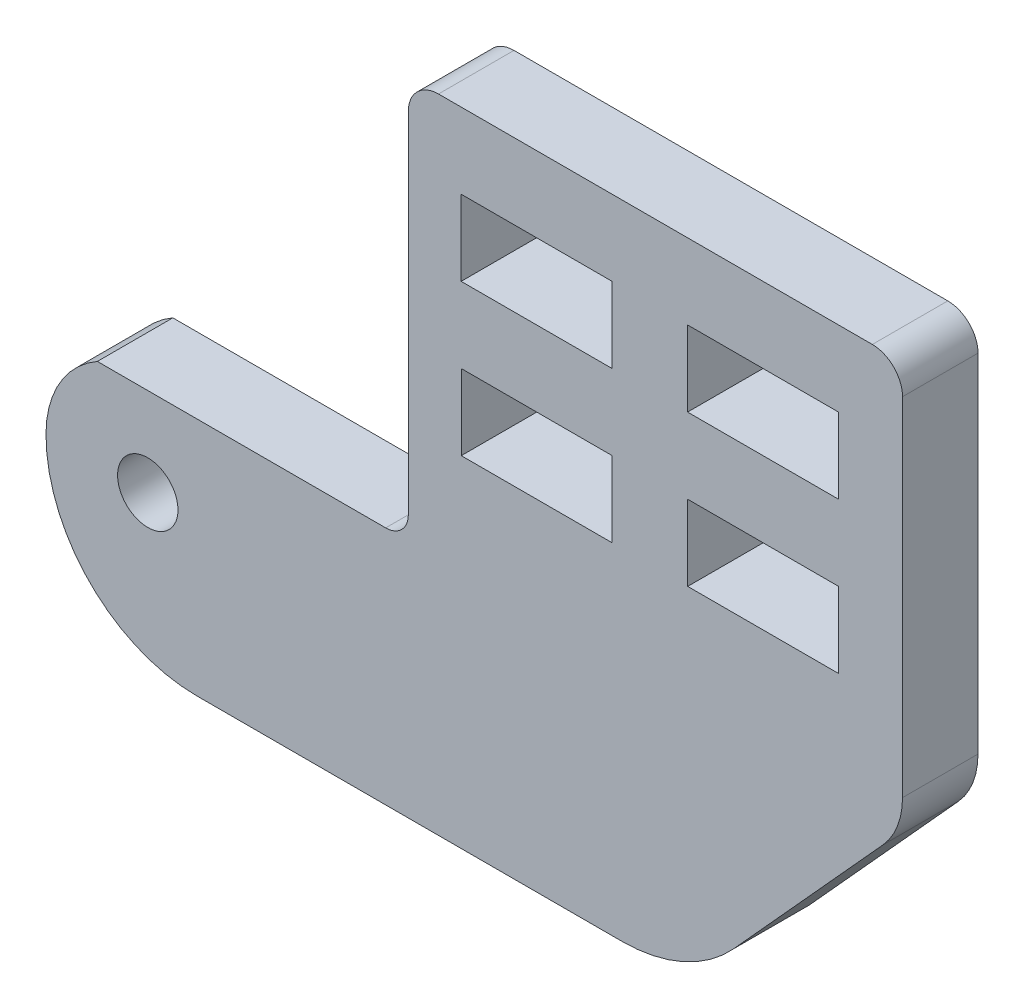
ISO-10303-21;
HEADER;
FILE_DESCRIPTION(('STEP AP214'),'2;1');
FILE_NAME('part.step','',(''),(''),'','','');
FILE_SCHEMA(('AUTOMOTIVE_DESIGN { 1 0 10303 214 1 1 1 1 }'));
ENDSEC;
DATA;
#1=APPLICATION_CONTEXT('core data for automotive mechanical design processes');
#2=APPLICATION_PROTOCOL_DEFINITION('international standard','automotive_design',2000,#1);
#3=PRODUCT_CONTEXT('',#1,'mechanical');
#4=PRODUCT('Part','Part','',(#3));
#5=PRODUCT_RELATED_PRODUCT_CATEGORY('part','',(#4));
#6=PRODUCT_DEFINITION_FORMATION('','',#4);
#7=PRODUCT_DEFINITION_CONTEXT('part definition',#1,'design');
#8=PRODUCT_DEFINITION('design','',#6,#7);
#9=PRODUCT_DEFINITION_SHAPE('','',#8);
#10=(LENGTH_UNIT() NAMED_UNIT(*) SI_UNIT(.MILLI.,.METRE.));
#11=(NAMED_UNIT(*) PLANE_ANGLE_UNIT() SI_UNIT($,.RADIAN.));
#12=(NAMED_UNIT(*) SI_UNIT($,.STERADIAN.) SOLID_ANGLE_UNIT());
#13=UNCERTAINTY_MEASURE_WITH_UNIT(LENGTH_MEASURE(1.E-05),#10,'distance_accuracy_value','');
#14=(GEOMETRIC_REPRESENTATION_CONTEXT(3) GLOBAL_UNCERTAINTY_ASSIGNED_CONTEXT((#13)) GLOBAL_UNIT_ASSIGNED_CONTEXT((#10,
#11,#12)) REPRESENTATION_CONTEXT('',''));
#15=CARTESIAN_POINT('',(0.,0.,0.));
#16=DIRECTION('',(0.,0.,1.));
#17=DIRECTION('',(1.,0.,0.));
#18=AXIS2_PLACEMENT_3D('',#15,#16,#17);
#19=CARTESIAN_POINT('',(-1.74201988749175,-0.0393095547088036,5.));
#20=DIRECTION('',(0.,0.,1.));
#21=DIRECTION('',(1.,0.,0.));
#22=AXIS2_PLACEMENT_3D('',#19,#20,#21);
#23=PLANE('',#22);
#24=CARTESIAN_POINT('',(-1.74201988749175,-0.0393095547088036,5.));
#25=DIRECTION('',(0.,0.,1.));
#26=DIRECTION('',(1.,0.,0.));
#27=AXIS2_PLACEMENT_3D('',#24,#25,#26);
#28=CIRCLE('',#27,10.);
#29=CARTESIAN_POINT('',(-11.7419426251387,0.,5.));
#30=VERTEX_POINT('',#29);
#31=CARTESIAN_POINT('',(-1.74201988749165,-10.0393095547088,5.));
#32=VERTEX_POINT('',#31);
#33=EDGE_CURVE('E358',#30,#32,#28,.T.);
#34=ORIENTED_EDGE('',*,*,#33,.T.);
#35=DIRECTION('',(1.,0.,0.));
#36=VECTOR('',#35,1.);
#37=CARTESIAN_POINT('',(-1.74201988749165,-10.0393095547088,5.));
#38=LINE('',#37,#36);
#39=CARTESIAN_POINT('',(26.4116259065431,-10.0393095547088,5.));
#40=VERTEX_POINT('',#39);
#41=EDGE_CURVE('E361',#32,#40,#38,.T.);
#42=ORIENTED_EDGE('',*,*,#41,.T.);
#43=CARTESIAN_POINT('',(26.4116259065431,-0.0393095547088045,5.));
#44=DIRECTION('',(0.,0.,1.));
#45=DIRECTION('',(-1.,0.,0.));
#46=AXIS2_PLACEMENT_3D('',#43,#44,#45);
#47=CIRCLE('',#46,10.);
#48=CARTESIAN_POINT('',(33.8187494073413,-6.75753264150215,5.));
#49=VERTEX_POINT('',#48);
#50=EDGE_CURVE('E364',#40,#49,#47,.T.);
#51=ORIENTED_EDGE('',*,*,#50,.T.);
#52=DIRECTION('',(0.671822308679337,0.740712350079817,0.));
#53=VECTOR('',#52,1.);
#54=CARTESIAN_POINT('',(43.703561537583,4.14088845660329,5.));
#55=LINE('',#54,#53);
#56=CARTESIAN_POINT('',(43.703561537583,4.14088845660329,5.));
#57=VERTEX_POINT('',#56);
#58=EDGE_CURVE('E366',#49,#57,#55,.T.);
#59=ORIENTED_EDGE('',*,*,#58,.T.);
#60=CARTESIAN_POINT('',(39.9999997871839,7.49999999999998,5.));
#61=DIRECTION('',(0.,0.,1.));
#62=DIRECTION('',(-1.,0.,0.));
#63=AXIS2_PLACEMENT_3D('',#60,#61,#62);
#64=CIRCLE('',#63,5.);
#65=CARTESIAN_POINT('',(44.9999997871839,7.5,5.));
#66=VERTEX_POINT('',#65);
#67=EDGE_CURVE('E368',#57,#66,#64,.T.);
#68=ORIENTED_EDGE('',*,*,#67,.T.);
#69=DIRECTION('',(0.,1.,0.));
#70=VECTOR('',#69,1.);
#71=CARTESIAN_POINT('',(44.9999997871839,7.5,5.));
#72=LINE('',#71,#70);
#73=CARTESIAN_POINT('',(44.9999997871839,30.5,5.));
#74=VERTEX_POINT('',#73);
#75=EDGE_CURVE('E370',#66,#74,#72,.T.);
#76=ORIENTED_EDGE('',*,*,#75,.T.);
#77=CARTESIAN_POINT('',(42.9999997871839,30.5,5.));
#78=DIRECTION('',(0.,0.,1.));
#79=DIRECTION('',(1.,0.,0.));
#80=AXIS2_PLACEMENT_3D('',#77,#78,#79);
#81=CIRCLE('',#80,2.);
#82=CARTESIAN_POINT('',(42.9999997871839,32.5,5.));
#83=VERTEX_POINT('',#82);
#84=EDGE_CURVE('E372',#74,#83,#81,.T.);
#85=ORIENTED_EDGE('',*,*,#84,.T.);
#86=DIRECTION('',(-1.,0.,0.));
#87=VECTOR('',#86,1.);
#88=CARTESIAN_POINT('',(14.2603625156181,32.5,5.));
#89=LINE('',#88,#87);
#90=CARTESIAN_POINT('',(14.2603625156181,32.5,5.));
#91=VERTEX_POINT('',#90);
#92=EDGE_CURVE('E374',#83,#91,#89,.T.);
#93=ORIENTED_EDGE('',*,*,#92,.T.);
#94=CARTESIAN_POINT('',(14.260362515618,30.5,5.));
#95=DIRECTION('',(0.,0.,1.));
#96=DIRECTION('',(-1.,0.,0.));
#97=AXIS2_PLACEMENT_3D('',#94,#95,#96);
#98=CIRCLE('',#97,2.);
#99=CARTESIAN_POINT('',(12.260362515618,30.5,5.));
#100=VERTEX_POINT('',#99);
#101=EDGE_CURVE('E376',#91,#100,#98,.T.);
#102=ORIENTED_EDGE('',*,*,#101,.T.);
#103=DIRECTION('',(0.,-1.,0.));
#104=VECTOR('',#103,1.);
#105=CARTESIAN_POINT('',(12.260362515618,7.35621750937084,5.));
#106=LINE('',#105,#104);
#107=CARTESIAN_POINT('',(12.260362515618,7.35621750937084,5.));
#108=VERTEX_POINT('',#107);
#109=EDGE_CURVE('E378',#100,#108,#106,.T.);
#110=ORIENTED_EDGE('',*,*,#109,.T.);
#111=CARTESIAN_POINT('',(10.760362515618,7.35621750937083,5.));
#112=DIRECTION('',(0.,0.,-1.));
#113=DIRECTION('',(-1.,0.,0.));
#114=AXIS2_PLACEMENT_3D('',#111,#112,#113);
#115=CIRCLE('',#114,1.5);
#116=CARTESIAN_POINT('',(10.760362515618,5.85621750937083,5.));
#117=VERTEX_POINT('',#116);
#118=EDGE_CURVE('E380',#108,#117,#115,.T.);
#119=ORIENTED_EDGE('',*,*,#118,.T.);
#120=DIRECTION('',(-1.,0.,0.));
#121=VECTOR('',#120,1.);
#122=CARTESIAN_POINT('',(10.760362515618,5.85621750937083,5.));
#123=LINE('',#122,#121);
#124=CARTESIAN_POINT('',(-8.34043512788392,5.85621750937083,5.));
#125=VERTEX_POINT('',#124);
#126=EDGE_CURVE('E382',#117,#125,#123,.T.);
#127=ORIENTED_EDGE('',*,*,#126,.T.);
#128=CARTESIAN_POINT('',(-5.,0.,5.));
#129=DIRECTION('',(0.,0.,1.));
#130=DIRECTION('',(-1.,0.,0.));
#131=AXIS2_PLACEMENT_3D('',#128,#129,#130);
#132=CIRCLE('',#131,6.74194262513871);
#133=EDGE_CURVE('E384',#125,#30,#132,.T.);
#134=ORIENTED_EDGE('',*,*,#133,.T.);
#135=EDGE_LOOP('',(#34,#42,#51,#59,#68,#76,#85,#93,#102,#110,#119,#127,#134));
#136=FACE_BOUND('',#135,.T.);
#137=CARTESIAN_POINT('',(-5.,0.,5.));
#138=DIRECTION('',(0.,0.,1.));
#139=DIRECTION('',(1.,0.,0.));
#140=AXIS2_PLACEMENT_3D('',#137,#138,#139);
#141=CIRCLE('',#140,2.);
#142=CARTESIAN_POINT('',(-3.,0.,5.));
#143=VERTEX_POINT('',#142);
#144=EDGE_CURVE('E352',#143,#143,#141,.T.);
#145=ORIENTED_EDGE('',*,*,#144,.F.);
#146=EDGE_LOOP('',(#145));
#147=FACE_BOUND('',#146,.T.);
#148=DIRECTION('',(1.,0.,0.));
#149=VECTOR('',#148,1.);
#150=CARTESIAN_POINT('',(15.760362515618,22.5,5.));
#151=LINE('',#150,#149);
#152=CARTESIAN_POINT('',(15.760362515618,22.5,5.));
#153=VERTEX_POINT('',#152);
#154=CARTESIAN_POINT('',(25.760362515618,22.5,5.));
#155=VERTEX_POINT('',#154);
#156=EDGE_CURVE('E323',#153,#155,#151,.T.);
#157=ORIENTED_EDGE('',*,*,#156,.F.);
#158=DIRECTION('',(0.,-1.,0.));
#159=VECTOR('',#158,1.);
#160=CARTESIAN_POINT('',(15.760362515618,27.5,5.));
#161=LINE('',#160,#159);
#162=CARTESIAN_POINT('',(15.760362515618,27.5,5.));
#163=VERTEX_POINT('',#162);
#164=EDGE_CURVE('E321',#163,#153,#161,.T.);
#165=ORIENTED_EDGE('',*,*,#164,.F.);
#166=DIRECTION('',(-1.,0.,0.));
#167=VECTOR('',#166,1.);
#168=CARTESIAN_POINT('',(15.760362515618,27.5,5.));
#169=LINE('',#168,#167);
#170=CARTESIAN_POINT('',(25.760362515618,27.5,5.));
#171=VERTEX_POINT('',#170);
#172=EDGE_CURVE('E329',#171,#163,#169,.T.);
#173=ORIENTED_EDGE('',*,*,#172,.F.);
#174=DIRECTION('',(0.,1.,0.));
#175=VECTOR('',#174,1.);
#176=CARTESIAN_POINT('',(25.760362515618,27.5,5.));
#177=LINE('',#176,#175);
#178=EDGE_CURVE('E326',#155,#171,#177,.T.);
#179=ORIENTED_EDGE('',*,*,#178,.F.);
#180=EDGE_LOOP('',(#157,#165,#173,#179));
#181=FACE_BOUND('',#180,.T.);
#182=DIRECTION('',(1.,0.,0.));
#183=VECTOR('',#182,1.);
#184=CARTESIAN_POINT('',(30.760362515618,22.5,5.));
#185=LINE('',#184,#183);
#186=CARTESIAN_POINT('',(30.760362515618,22.5,5.));
#187=VERTEX_POINT('',#186);
#188=CARTESIAN_POINT('',(40.760362515618,22.5,5.));
#189=VERTEX_POINT('',#188);
#190=EDGE_CURVE('E292',#187,#189,#185,.T.);
#191=ORIENTED_EDGE('',*,*,#190,.F.);
#192=DIRECTION('',(0.,-1.,0.));
#193=VECTOR('',#192,1.);
#194=CARTESIAN_POINT('',(30.760362515618,27.5,5.));
#195=LINE('',#194,#193);
#196=CARTESIAN_POINT('',(30.760362515618,27.5,5.));
#197=VERTEX_POINT('',#196);
#198=EDGE_CURVE('E290',#197,#187,#195,.T.);
#199=ORIENTED_EDGE('',*,*,#198,.F.);
#200=DIRECTION('',(-1.,0.,0.));
#201=VECTOR('',#200,1.);
#202=CARTESIAN_POINT('',(30.760362515618,27.5,5.));
#203=LINE('',#202,#201);
#204=CARTESIAN_POINT('',(40.760362515618,27.5,5.));
#205=VERTEX_POINT('',#204);
#206=EDGE_CURVE('E298',#205,#197,#203,.T.);
#207=ORIENTED_EDGE('',*,*,#206,.F.);
#208=DIRECTION('',(0.,1.,0.));
#209=VECTOR('',#208,1.);
#210=CARTESIAN_POINT('',(40.760362515618,27.5,5.));
#211=LINE('',#210,#209);
#212=EDGE_CURVE('E295',#189,#205,#211,.T.);
#213=ORIENTED_EDGE('',*,*,#212,.F.);
#214=EDGE_LOOP('',(#191,#199,#207,#213));
#215=FACE_BOUND('',#214,.T.);
#216=DIRECTION('',(1.,0.,0.));
#217=VECTOR('',#216,1.);
#218=CARTESIAN_POINT('',(15.7685598453756,12.5031103441985,5.));
#219=LINE('',#218,#217);
#220=CARTESIAN_POINT('',(15.7685598453756,12.5031103441985,5.));
#221=VERTEX_POINT('',#220);
#222=CARTESIAN_POINT('',(25.7685598453756,12.5031103441985,5.));
#223=VERTEX_POINT('',#222);
#224=EDGE_CURVE('E261',#221,#223,#219,.T.);
#225=ORIENTED_EDGE('',*,*,#224,.F.);
#226=DIRECTION('',(0.,-1.,0.));
#227=VECTOR('',#226,1.);
#228=CARTESIAN_POINT('',(15.7685598453756,17.5031103441985,5.));
#229=LINE('',#228,#227);
#230=CARTESIAN_POINT('',(15.7685598453756,17.5031103441985,5.));
#231=VERTEX_POINT('',#230);
#232=EDGE_CURVE('E259',#231,#221,#229,.T.);
#233=ORIENTED_EDGE('',*,*,#232,.F.);
#234=DIRECTION('',(-1.,0.,0.));
#235=VECTOR('',#234,1.);
#236=CARTESIAN_POINT('',(15.7685598453756,17.5031103441985,5.));
#237=LINE('',#236,#235);
#238=CARTESIAN_POINT('',(25.7685598453756,17.5031103441985,5.));
#239=VERTEX_POINT('',#238);
#240=EDGE_CURVE('E267',#239,#231,#237,.T.);
#241=ORIENTED_EDGE('',*,*,#240,.F.);
#242=DIRECTION('',(0.,1.,0.));
#243=VECTOR('',#242,1.);
#244=CARTESIAN_POINT('',(25.7685598453756,17.5031103441985,5.));
#245=LINE('',#244,#243);
#246=EDGE_CURVE('E264',#223,#239,#245,.T.);
#247=ORIENTED_EDGE('',*,*,#246,.F.);
#248=EDGE_LOOP('',(#225,#233,#241,#247));
#249=FACE_BOUND('',#248,.T.);
#250=DIRECTION('',(1.,0.,0.));
#251=VECTOR('',#250,1.);
#252=CARTESIAN_POINT('',(30.7685598453756,12.5031103441985,5.));
#253=LINE('',#252,#251);
#254=CARTESIAN_POINT('',(30.7685598453756,12.5031103441985,5.));
#255=VERTEX_POINT('',#254);
#256=CARTESIAN_POINT('',(40.7685598453756,12.5031103441985,5.));
#257=VERTEX_POINT('',#256);
#258=EDGE_CURVE('E231',#255,#257,#253,.T.);
#259=ORIENTED_EDGE('',*,*,#258,.F.);
#260=DIRECTION('',(0.,-1.,0.));
#261=VECTOR('',#260,1.);
#262=CARTESIAN_POINT('',(30.7685598453756,17.5031103441985,5.));
#263=LINE('',#262,#261);
#264=CARTESIAN_POINT('',(30.7685598453756,17.5031103441985,5.));
#265=VERTEX_POINT('',#264);
#266=EDGE_CURVE('E223',#265,#255,#263,.T.);
#267=ORIENTED_EDGE('',*,*,#266,.F.);
#268=DIRECTION('',(-1.,0.,0.));
#269=VECTOR('',#268,1.);
#270=CARTESIAN_POINT('',(30.7685598453756,17.5031103441985,5.));
#271=LINE('',#270,#269);
#272=CARTESIAN_POINT('',(40.7685598453756,17.5031103441985,5.));
#273=VERTEX_POINT('',#272);
#274=EDGE_CURVE('E245',#273,#265,#271,.T.);
#275=ORIENTED_EDGE('',*,*,#274,.F.);
#276=DIRECTION('',(0.,1.,0.));
#277=VECTOR('',#276,1.);
#278=CARTESIAN_POINT('',(40.7685598453756,17.5031103441985,5.));
#279=LINE('',#278,#277);
#280=EDGE_CURVE('E243',#257,#273,#279,.T.);
#281=ORIENTED_EDGE('',*,*,#280,.F.);
#282=EDGE_LOOP('',(#259,#267,#275,#281));
#283=FACE_BOUND('',#282,.T.);
#284=ADVANCED_FACE('F32',(#136,#147,#181,#215,#249,#283),#23,.T.);
#285=CARTESIAN_POINT('',(-1.74201988749175,-0.0393095547088036,0.));
#286=DIRECTION('',(0.,0.,1.));
#287=DIRECTION('',(1.,0.,0.));
#288=AXIS2_PLACEMENT_3D('',#285,#286,#287);
#289=PLANE('',#288);
#290=DIRECTION('',(0.,-1.,0.));
#291=VECTOR('',#290,1.);
#292=CARTESIAN_POINT('',(15.7685598453756,17.5031103441985,0.));
#293=LINE('',#292,#291);
#294=CARTESIAN_POINT('',(15.7685598453756,17.5031103441985,0.));
#295=VERTEX_POINT('',#294);
#296=CARTESIAN_POINT('',(15.7685598453756,12.5031103441985,0.));
#297=VERTEX_POINT('',#296);
#298=EDGE_CURVE('E239',#295,#297,#293,.T.);
#299=ORIENTED_EDGE('',*,*,#298,.T.);
#300=DIRECTION('',(1.,0.,0.));
#301=VECTOR('',#300,1.);
#302=CARTESIAN_POINT('',(15.7685598453756,12.5031103441985,0.));
#303=LINE('',#302,#301);
#304=CARTESIAN_POINT('',(25.7685598453756,12.5031103441985,0.));
#305=VERTEX_POINT('',#304);
#306=EDGE_CURVE('E272',#297,#305,#303,.T.);
#307=ORIENTED_EDGE('',*,*,#306,.T.);
#308=DIRECTION('',(0.,1.,0.));
#309=VECTOR('',#308,1.);
#310=CARTESIAN_POINT('',(25.7685598453756,17.5031103441985,0.));
#311=LINE('',#310,#309);
#312=CARTESIAN_POINT('',(25.7685598453756,17.5031103441985,0.));
#313=VERTEX_POINT('',#312);
#314=EDGE_CURVE('E275',#305,#313,#311,.T.);
#315=ORIENTED_EDGE('',*,*,#314,.T.);
#316=DIRECTION('',(-1.,0.,0.));
#317=VECTOR('',#316,1.);
#318=CARTESIAN_POINT('',(15.7685598453756,17.5031103441985,0.));
#319=LINE('',#318,#317);
#320=EDGE_CURVE('E262',#313,#295,#319,.T.);
#321=ORIENTED_EDGE('',*,*,#320,.T.);
#322=EDGE_LOOP('',(#299,#307,#315,#321));
#323=FACE_BOUND('',#322,.T.);
#324=DIRECTION('',(0.,-1.,0.));
#325=VECTOR('',#324,1.);
#326=CARTESIAN_POINT('',(15.760362515618,27.5,0.));
#327=LINE('',#326,#325);
#328=CARTESIAN_POINT('',(15.760362515618,27.5,0.));
#329=VERTEX_POINT('',#328);
#330=CARTESIAN_POINT('',(15.760362515618,22.5,0.));
#331=VERTEX_POINT('',#330);
#332=EDGE_CURVE('E320',#329,#331,#327,.T.);
#333=ORIENTED_EDGE('',*,*,#332,.T.);
#334=DIRECTION('',(1.,0.,0.));
#335=VECTOR('',#334,1.);
#336=CARTESIAN_POINT('',(15.760362515618,22.5,0.));
#337=LINE('',#336,#335);
#338=CARTESIAN_POINT('',(25.760362515618,22.5,0.));
#339=VERTEX_POINT('',#338);
#340=EDGE_CURVE('E334',#331,#339,#337,.T.);
#341=ORIENTED_EDGE('',*,*,#340,.T.);
#342=DIRECTION('',(0.,1.,0.));
#343=VECTOR('',#342,1.);
#344=CARTESIAN_POINT('',(25.760362515618,27.5,0.));
#345=LINE('',#344,#343);
#346=CARTESIAN_POINT('',(25.760362515618,27.5,0.));
#347=VERTEX_POINT('',#346);
#348=EDGE_CURVE('E337',#339,#347,#345,.T.);
#349=ORIENTED_EDGE('',*,*,#348,.T.);
#350=DIRECTION('',(-1.,0.,0.));
#351=VECTOR('',#350,1.);
#352=CARTESIAN_POINT('',(15.760362515618,27.5,0.));
#353=LINE('',#352,#351);
#354=EDGE_CURVE('E324',#347,#329,#353,.T.);
#355=ORIENTED_EDGE('',*,*,#354,.T.);
#356=EDGE_LOOP('',(#333,#341,#349,#355));
#357=FACE_BOUND('',#356,.T.);
#358=CARTESIAN_POINT('',(-1.74201988749175,-0.0393095547088036,0.));
#359=DIRECTION('',(0.,0.,1.));
#360=DIRECTION('',(1.,0.,0.));
#361=AXIS2_PLACEMENT_3D('',#358,#359,#360);
#362=CIRCLE('',#361,10.);
#363=CARTESIAN_POINT('',(-11.7419426251387,0.,0.));
#364=VERTEX_POINT('',#363);
#365=CARTESIAN_POINT('',(-1.74201988749165,-10.0393095547088,0.));
#366=VERTEX_POINT('',#365);
#367=EDGE_CURVE('E355',#364,#366,#362,.T.);
#368=ORIENTED_EDGE('',*,*,#367,.F.);
#369=CARTESIAN_POINT('',(-5.,0.,0.));
#370=DIRECTION('',(0.,0.,1.));
#371=DIRECTION('',(-1.,0.,0.));
#372=AXIS2_PLACEMENT_3D('',#369,#370,#371);
#373=CIRCLE('',#372,6.74194262513871);
#374=CARTESIAN_POINT('',(-8.34043512788392,5.85621750937083,0.));
#375=VERTEX_POINT('',#374);
#376=EDGE_CURVE('E362',#375,#364,#373,.T.);
#377=ORIENTED_EDGE('',*,*,#376,.F.);
#378=DIRECTION('',(-1.,0.,0.));
#379=VECTOR('',#378,1.);
#380=CARTESIAN_POINT('',(10.760362515618,5.85621750937083,0.));
#381=LINE('',#380,#379);
#382=CARTESIAN_POINT('',(10.760362515618,5.85621750937083,0.));
#383=VERTEX_POINT('',#382);
#384=EDGE_CURVE('E409',#383,#375,#381,.T.);
#385=ORIENTED_EDGE('',*,*,#384,.F.);
#386=CARTESIAN_POINT('',(10.760362515618,7.35621750937083,0.));
#387=DIRECTION('',(0.,0.,-1.));
#388=DIRECTION('',(-1.,0.,0.));
#389=AXIS2_PLACEMENT_3D('',#386,#387,#388);
#390=CIRCLE('',#389,1.5);
#391=CARTESIAN_POINT('',(12.260362515618,7.35621750937084,0.));
#392=VERTEX_POINT('',#391);
#393=EDGE_CURVE('E407',#392,#383,#390,.T.);
#394=ORIENTED_EDGE('',*,*,#393,.F.);
#395=DIRECTION('',(0.,-1.,0.));
#396=VECTOR('',#395,1.);
#397=CARTESIAN_POINT('',(12.260362515618,7.35621750937084,0.));
#398=LINE('',#397,#396);
#399=CARTESIAN_POINT('',(12.260362515618,30.5,0.));
#400=VERTEX_POINT('',#399);
#401=EDGE_CURVE('E405',#400,#392,#398,.T.);
#402=ORIENTED_EDGE('',*,*,#401,.F.);
#403=CARTESIAN_POINT('',(14.260362515618,30.5,0.));
#404=DIRECTION('',(0.,0.,1.));
#405=DIRECTION('',(-1.,0.,0.));
#406=AXIS2_PLACEMENT_3D('',#403,#404,#405);
#407=CIRCLE('',#406,2.);
#408=CARTESIAN_POINT('',(14.2603625156181,32.5,0.));
#409=VERTEX_POINT('',#408);
#410=EDGE_CURVE('E403',#409,#400,#407,.T.);
#411=ORIENTED_EDGE('',*,*,#410,.F.);
#412=DIRECTION('',(-1.,0.,0.));
#413=VECTOR('',#412,1.);
#414=CARTESIAN_POINT('',(14.2603625156181,32.5,0.));
#415=LINE('',#414,#413);
#416=CARTESIAN_POINT('',(42.9999997871839,32.5,0.));
#417=VERTEX_POINT('',#416);
#418=EDGE_CURVE('E401',#417,#409,#415,.T.);
#419=ORIENTED_EDGE('',*,*,#418,.F.);
#420=CARTESIAN_POINT('',(42.9999997871839,30.5,0.));
#421=DIRECTION('',(0.,0.,1.));
#422=DIRECTION('',(1.,0.,0.));
#423=AXIS2_PLACEMENT_3D('',#420,#421,#422);
#424=CIRCLE('',#423,2.);
#425=CARTESIAN_POINT('',(44.9999997871839,30.5,0.));
#426=VERTEX_POINT('',#425);
#427=EDGE_CURVE('E399',#426,#417,#424,.T.);
#428=ORIENTED_EDGE('',*,*,#427,.F.);
#429=DIRECTION('',(0.,1.,0.));
#430=VECTOR('',#429,1.);
#431=CARTESIAN_POINT('',(44.9999997871839,7.5,0.));
#432=LINE('',#431,#430);
#433=CARTESIAN_POINT('',(44.9999997871839,7.5,0.));
#434=VERTEX_POINT('',#433);
#435=EDGE_CURVE('E397',#434,#426,#432,.T.);
#436=ORIENTED_EDGE('',*,*,#435,.F.);
#437=CARTESIAN_POINT('',(39.9999997871839,7.49999999999998,0.));
#438=DIRECTION('',(0.,0.,1.));
#439=DIRECTION('',(-1.,0.,0.));
#440=AXIS2_PLACEMENT_3D('',#437,#438,#439);
#441=CIRCLE('',#440,5.);
#442=CARTESIAN_POINT('',(43.703561537583,4.14088845660329,0.));
#443=VERTEX_POINT('',#442);
#444=EDGE_CURVE('E395',#443,#434,#441,.T.);
#445=ORIENTED_EDGE('',*,*,#444,.F.);
#446=DIRECTION('',(0.671822308679337,0.740712350079817,0.));
#447=VECTOR('',#446,1.);
#448=CARTESIAN_POINT('',(43.703561537583,4.14088845660329,0.));
#449=LINE('',#448,#447);
#450=CARTESIAN_POINT('',(33.8187494073413,-6.75753264150215,0.));
#451=VERTEX_POINT('',#450);
#452=EDGE_CURVE('E393',#451,#443,#449,.T.);
#453=ORIENTED_EDGE('',*,*,#452,.F.);
#454=CARTESIAN_POINT('',(26.4116259065431,-0.0393095547088045,0.));
#455=DIRECTION('',(0.,0.,1.));
#456=DIRECTION('',(-1.,0.,0.));
#457=AXIS2_PLACEMENT_3D('',#454,#455,#456);
#458=CIRCLE('',#457,10.);
#459=CARTESIAN_POINT('',(26.4116259065431,-10.0393095547088,0.));
#460=VERTEX_POINT('',#459);
#461=EDGE_CURVE('E391',#460,#451,#458,.T.);
#462=ORIENTED_EDGE('',*,*,#461,.F.);
#463=DIRECTION('',(1.,0.,0.));
#464=VECTOR('',#463,1.);
#465=CARTESIAN_POINT('',(-1.74201988749165,-10.0393095547088,0.));
#466=LINE('',#465,#464);
#467=EDGE_CURVE('E389',#366,#460,#466,.T.);
#468=ORIENTED_EDGE('',*,*,#467,.F.);
#469=EDGE_LOOP('',(#368,#377,#385,#394,#402,#411,#419,#428,#436,#445,#453,#462,#468));
#470=FACE_BOUND('',#469,.T.);
#471=CARTESIAN_POINT('',(-5.,0.,0.));
#472=DIRECTION('',(0.,0.,1.));
#473=DIRECTION('',(1.,0.,0.));
#474=AXIS2_PLACEMENT_3D('',#471,#472,#473);
#475=CIRCLE('',#474,2.);
#476=CARTESIAN_POINT('',(-3.,0.,0.));
#477=VERTEX_POINT('',#476);
#478=EDGE_CURVE('E351',#477,#477,#475,.T.);
#479=ORIENTED_EDGE('',*,*,#478,.T.);
#480=EDGE_LOOP('',(#479));
#481=FACE_BOUND('',#480,.T.);
#482=DIRECTION('',(0.,-1.,0.));
#483=VECTOR('',#482,1.);
#484=CARTESIAN_POINT('',(30.760362515618,27.5,0.));
#485=LINE('',#484,#483);
#486=CARTESIAN_POINT('',(30.760362515618,27.5,0.));
#487=VERTEX_POINT('',#486);
#488=CARTESIAN_POINT('',(30.760362515618,22.5,0.));
#489=VERTEX_POINT('',#488);
#490=EDGE_CURVE('E289',#487,#489,#485,.T.);
#491=ORIENTED_EDGE('',*,*,#490,.T.);
#492=DIRECTION('',(1.,0.,0.));
#493=VECTOR('',#492,1.);
#494=CARTESIAN_POINT('',(30.760362515618,22.5,0.));
#495=LINE('',#494,#493);
#496=CARTESIAN_POINT('',(40.760362515618,22.5,0.));
#497=VERTEX_POINT('',#496);
#498=EDGE_CURVE('E303',#489,#497,#495,.T.);
#499=ORIENTED_EDGE('',*,*,#498,.T.);
#500=DIRECTION('',(0.,1.,0.));
#501=VECTOR('',#500,1.);
#502=CARTESIAN_POINT('',(40.760362515618,27.5,0.));
#503=LINE('',#502,#501);
#504=CARTESIAN_POINT('',(40.760362515618,27.5,0.));
#505=VERTEX_POINT('',#504);
#506=EDGE_CURVE('E306',#497,#505,#503,.T.);
#507=ORIENTED_EDGE('',*,*,#506,.T.);
#508=DIRECTION('',(-1.,0.,0.));
#509=VECTOR('',#508,1.);
#510=CARTESIAN_POINT('',(30.760362515618,27.5,0.));
#511=LINE('',#510,#509);
#512=EDGE_CURVE('E293',#505,#487,#511,.T.);
#513=ORIENTED_EDGE('',*,*,#512,.T.);
#514=EDGE_LOOP('',(#491,#499,#507,#513));
#515=FACE_BOUND('',#514,.T.);
#516=DIRECTION('',(0.,-1.,0.));
#517=VECTOR('',#516,1.);
#518=CARTESIAN_POINT('',(30.7685598453756,17.5031103441985,0.));
#519=LINE('',#518,#517);
#520=CARTESIAN_POINT('',(30.7685598453756,17.5031103441985,0.));
#521=VERTEX_POINT('',#520);
#522=CARTESIAN_POINT('',(30.7685598453756,12.5031103441985,0.));
#523=VERTEX_POINT('',#522);
#524=EDGE_CURVE('E55',#521,#523,#519,.T.);
#525=ORIENTED_EDGE('',*,*,#524,.T.);
#526=DIRECTION('',(1.,0.,0.));
#527=VECTOR('',#526,1.);
#528=CARTESIAN_POINT('',(30.7685598453756,12.5031103441985,0.));
#529=LINE('',#528,#527);
#530=CARTESIAN_POINT('',(40.7685598453756,12.5031103441985,0.));
#531=VERTEX_POINT('',#530);
#532=EDGE_CURVE('E238',#523,#531,#529,.T.);
#533=ORIENTED_EDGE('',*,*,#532,.T.);
#534=DIRECTION('',(0.,1.,0.));
#535=VECTOR('',#534,1.);
#536=CARTESIAN_POINT('',(40.7685598453756,17.5031103441985,0.));
#537=LINE('',#536,#535);
#538=CARTESIAN_POINT('',(40.7685598453756,17.5031103441985,0.));
#539=VERTEX_POINT('',#538);
#540=EDGE_CURVE('E251',#531,#539,#537,.T.);
#541=ORIENTED_EDGE('',*,*,#540,.T.);
#542=DIRECTION('',(-1.,0.,0.));
#543=VECTOR('',#542,1.);
#544=CARTESIAN_POINT('',(30.7685598453756,17.5031103441985,0.));
#545=LINE('',#544,#543);
#546=EDGE_CURVE('E232',#539,#521,#545,.T.);
#547=ORIENTED_EDGE('',*,*,#546,.T.);
#548=EDGE_LOOP('',(#525,#533,#541,#547));
#549=FACE_BOUND('',#548,.T.);
#550=ADVANCED_FACE('F454',(#323,#357,#470,#481,#515,#549),#289,.F.);
#551=CARTESIAN_POINT('',(-1.74201988749175,-0.0393095547088036,5.));
#552=DIRECTION('',(0.,0.,-1.));
#553=DIRECTION('',(-1.,0.,0.));
#554=AXIS2_PLACEMENT_3D('',#551,#552,#553);
#555=CYLINDRICAL_SURFACE('',#554,10.);
#556=ORIENTED_EDGE('',*,*,#367,.T.);
#557=DIRECTION('',(0.,0.,-1.));
#558=VECTOR('',#557,1.);
#559=CARTESIAN_POINT('',(-1.74201988749165,-10.0393095547088,5.));
#560=LINE('',#559,#558);
#561=EDGE_CURVE('E11',#32,#366,#560,.T.);
#562=ORIENTED_EDGE('',*,*,#561,.F.);
#563=ORIENTED_EDGE('',*,*,#33,.F.);
#564=DIRECTION('',(0.,0.,-1.));
#565=VECTOR('',#564,1.);
#566=CARTESIAN_POINT('',(-11.7419426251387,0.,5.));
#567=LINE('',#566,#565);
#568=EDGE_CURVE('E386',#30,#364,#567,.T.);
#569=ORIENTED_EDGE('',*,*,#568,.T.);
#570=EDGE_LOOP('',(#556,#562,#563,#569));
#571=FACE_BOUND('',#570,.T.);
#572=ADVANCED_FACE('F34',(#571),#555,.T.);
#573=CARTESIAN_POINT('',(-1.74201988749165,-10.0393095547088,5.));
#574=DIRECTION('',(0.,1.,0.));
#575=DIRECTION('',(0.,0.,1.));
#576=AXIS2_PLACEMENT_3D('',#573,#574,#575);
#577=PLANE('',#576);
#578=ORIENTED_EDGE('',*,*,#467,.T.);
#579=DIRECTION('',(0.,0.,-1.));
#580=VECTOR('',#579,1.);
#581=CARTESIAN_POINT('',(26.4116259065431,-10.0393095547088,5.));
#582=LINE('',#581,#580);
#583=EDGE_CURVE('E40',#40,#460,#582,.T.);
#584=ORIENTED_EDGE('',*,*,#583,.F.);
#585=ORIENTED_EDGE('',*,*,#41,.F.);
#586=ORIENTED_EDGE('',*,*,#561,.T.);
#587=EDGE_LOOP('',(#578,#584,#585,#586));
#588=FACE_BOUND('',#587,.T.);
#589=ADVANCED_FACE('F472',(#588),#577,.F.);
#590=CARTESIAN_POINT('',(26.4116259065431,-0.0393095547088045,5.));
#591=DIRECTION('',(0.,0.,-1.));
#592=DIRECTION('',(-1.,0.,0.));
#593=AXIS2_PLACEMENT_3D('',#590,#591,#592);
#594=CYLINDRICAL_SURFACE('',#593,10.);
#595=ORIENTED_EDGE('',*,*,#461,.T.);
#596=DIRECTION('',(0.,0.,-1.));
#597=VECTOR('',#596,1.);
#598=CARTESIAN_POINT('',(33.8187494073413,-6.75753264150215,5.));
#599=LINE('',#598,#597);
#600=EDGE_CURVE('E441',#49,#451,#599,.T.);
#601=ORIENTED_EDGE('',*,*,#600,.F.);
#602=ORIENTED_EDGE('',*,*,#50,.F.);
#603=ORIENTED_EDGE('',*,*,#583,.T.);
#604=EDGE_LOOP('',(#595,#601,#602,#603));
#605=FACE_BOUND('',#604,.T.);
#606=ADVANCED_FACE('F448',(#605),#594,.T.);
#607=CARTESIAN_POINT('',(43.703561537583,4.14088845660329,5.));
#608=DIRECTION('',(-0.740712350079817,0.671822308679337,0.));
#609=DIRECTION('',(-0.671822308679337,-0.740712350079817,0.));
#610=AXIS2_PLACEMENT_3D('',#607,#608,#609);
#611=PLANE('',#610);
#612=ORIENTED_EDGE('',*,*,#452,.T.);
#613=DIRECTION('',(0.,0.,-1.));
#614=VECTOR('',#613,1.);
#615=CARTESIAN_POINT('',(43.703561537583,4.14088845660329,5.));
#616=LINE('',#615,#614);
#617=EDGE_CURVE('E438',#57,#443,#616,.T.);
#618=ORIENTED_EDGE('',*,*,#617,.F.);
#619=ORIENTED_EDGE('',*,*,#58,.F.);
#620=ORIENTED_EDGE('',*,*,#600,.T.);
#621=EDGE_LOOP('',(#612,#618,#619,#620));
#622=FACE_BOUND('',#621,.T.);
#623=ADVANCED_FACE('F460',(#622),#611,.F.);
#624=CARTESIAN_POINT('',(39.9999997871839,7.49999999999998,5.));
#625=DIRECTION('',(0.,0.,-1.));
#626=DIRECTION('',(-1.,0.,0.));
#627=AXIS2_PLACEMENT_3D('',#624,#625,#626);
#628=CYLINDRICAL_SURFACE('',#627,5.);
#629=ORIENTED_EDGE('',*,*,#444,.T.);
#630=DIRECTION('',(0.,0.,-1.));
#631=VECTOR('',#630,1.);
#632=CARTESIAN_POINT('',(44.9999997871839,7.5,5.));
#633=LINE('',#632,#631);
#634=EDGE_CURVE('E435',#66,#434,#633,.T.);
#635=ORIENTED_EDGE('',*,*,#634,.F.);
#636=ORIENTED_EDGE('',*,*,#67,.F.);
#637=ORIENTED_EDGE('',*,*,#617,.T.);
#638=EDGE_LOOP('',(#629,#635,#636,#637));
#639=FACE_BOUND('',#638,.T.);
#640=ADVANCED_FACE('F464',(#639),#628,.T.);
#641=CARTESIAN_POINT('',(44.9999997871839,7.5,5.));
#642=DIRECTION('',(-1.,0.,0.));
#643=DIRECTION('',(0.,0.,1.));
#644=AXIS2_PLACEMENT_3D('',#641,#642,#643);
#645=PLANE('',#644);
#646=ORIENTED_EDGE('',*,*,#435,.T.);
#647=DIRECTION('',(0.,0.,-1.));
#648=VECTOR('',#647,1.);
#649=CARTESIAN_POINT('',(44.9999997871839,30.5,5.));
#650=LINE('',#649,#648);
#651=EDGE_CURVE('E432',#74,#426,#650,.T.);
#652=ORIENTED_EDGE('',*,*,#651,.F.);
#653=ORIENTED_EDGE('',*,*,#75,.F.);
#654=ORIENTED_EDGE('',*,*,#634,.T.);
#655=EDGE_LOOP('',(#646,#652,#653,#654));
#656=FACE_BOUND('',#655,.T.);
#657=ADVANCED_FACE('F510',(#656),#645,.F.);
#658=CARTESIAN_POINT('',(42.9999997871839,30.5,5.));
#659=DIRECTION('',(0.,0.,-1.));
#660=DIRECTION('',(-1.,0.,0.));
#661=AXIS2_PLACEMENT_3D('',#658,#659,#660);
#662=CYLINDRICAL_SURFACE('',#661,2.);
#663=ORIENTED_EDGE('',*,*,#427,.T.);
#664=DIRECTION('',(0.,0.,-1.));
#665=VECTOR('',#664,1.);
#666=CARTESIAN_POINT('',(42.9999997871839,32.5,5.));
#667=LINE('',#666,#665);
#668=EDGE_CURVE('E429',#83,#417,#667,.T.);
#669=ORIENTED_EDGE('',*,*,#668,.F.);
#670=ORIENTED_EDGE('',*,*,#84,.F.);
#671=ORIENTED_EDGE('',*,*,#651,.T.);
#672=EDGE_LOOP('',(#663,#669,#670,#671));
#673=FACE_BOUND('',#672,.T.);
#674=ADVANCED_FACE('F507',(#673),#662,.T.);
#675=CARTESIAN_POINT('',(14.2603625156181,32.5,5.));
#676=DIRECTION('',(0.,-1.,0.));
#677=DIRECTION('',(1.,0.,0.));
#678=AXIS2_PLACEMENT_3D('',#675,#676,#677);
#679=PLANE('',#678);
#680=ORIENTED_EDGE('',*,*,#418,.T.);
#681=DIRECTION('',(0.,0.,-1.));
#682=VECTOR('',#681,1.);
#683=CARTESIAN_POINT('',(14.2603625156181,32.5,5.));
#684=LINE('',#683,#682);
#685=EDGE_CURVE('E426',#91,#409,#684,.T.);
#686=ORIENTED_EDGE('',*,*,#685,.F.);
#687=ORIENTED_EDGE('',*,*,#92,.F.);
#688=ORIENTED_EDGE('',*,*,#668,.T.);
#689=EDGE_LOOP('',(#680,#686,#687,#688));
#690=FACE_BOUND('',#689,.T.);
#691=ADVANCED_FACE('F503',(#690),#679,.F.);
#692=CARTESIAN_POINT('',(14.260362515618,30.5,5.));
#693=DIRECTION('',(0.,0.,-1.));
#694=DIRECTION('',(-1.,0.,0.));
#695=AXIS2_PLACEMENT_3D('',#692,#693,#694);
#696=CYLINDRICAL_SURFACE('',#695,2.);
#697=ORIENTED_EDGE('',*,*,#410,.T.);
#698=DIRECTION('',(0.,0.,-1.));
#699=VECTOR('',#698,1.);
#700=CARTESIAN_POINT('',(12.260362515618,30.5,5.));
#701=LINE('',#700,#699);
#702=EDGE_CURVE('E423',#100,#400,#701,.T.);
#703=ORIENTED_EDGE('',*,*,#702,.F.);
#704=ORIENTED_EDGE('',*,*,#101,.F.);
#705=ORIENTED_EDGE('',*,*,#685,.T.);
#706=EDGE_LOOP('',(#697,#703,#704,#705));
#707=FACE_BOUND('',#706,.T.);
#708=ADVANCED_FACE('F499',(#707),#696,.T.);
#709=CARTESIAN_POINT('',(12.260362515618,7.35621750937084,5.));
#710=DIRECTION('',(1.,0.,0.));
#711=DIRECTION('',(0.,0.,-1.));
#712=AXIS2_PLACEMENT_3D('',#709,#710,#711);
#713=PLANE('',#712);
#714=ORIENTED_EDGE('',*,*,#401,.T.);
#715=DIRECTION('',(0.,0.,-1.));
#716=VECTOR('',#715,1.);
#717=CARTESIAN_POINT('',(12.260362515618,7.35621750937084,5.));
#718=LINE('',#717,#716);
#719=EDGE_CURVE('E420',#108,#392,#718,.T.);
#720=ORIENTED_EDGE('',*,*,#719,.F.);
#721=ORIENTED_EDGE('',*,*,#109,.F.);
#722=ORIENTED_EDGE('',*,*,#702,.T.);
#723=EDGE_LOOP('',(#714,#720,#721,#722));
#724=FACE_BOUND('',#723,.T.);
#725=ADVANCED_FACE('F494',(#724),#713,.F.);
#726=CARTESIAN_POINT('',(10.760362515618,7.35621750937083,5.));
#727=DIRECTION('',(0.,0.,-1.));
#728=DIRECTION('',(-1.,0.,0.));
#729=AXIS2_PLACEMENT_3D('',#726,#727,#728);
#730=CYLINDRICAL_SURFACE('',#729,1.5);
#731=ORIENTED_EDGE('',*,*,#393,.T.);
#732=DIRECTION('',(0.,0.,-1.));
#733=VECTOR('',#732,1.);
#734=CARTESIAN_POINT('',(10.760362515618,5.85621750937083,5.));
#735=LINE('',#734,#733);
#736=EDGE_CURVE('E417',#117,#383,#735,.T.);
#737=ORIENTED_EDGE('',*,*,#736,.F.);
#738=ORIENTED_EDGE('',*,*,#118,.F.);
#739=ORIENTED_EDGE('',*,*,#719,.T.);
#740=EDGE_LOOP('',(#731,#737,#738,#739));
#741=FACE_BOUND('',#740,.T.);
#742=ADVANCED_FACE('F488',(#741),#730,.F.);
#743=CARTESIAN_POINT('',(10.760362515618,5.85621750937083,5.));
#744=DIRECTION('',(0.,-1.,0.));
#745=DIRECTION('',(1.,0.,0.));
#746=AXIS2_PLACEMENT_3D('',#743,#744,#745);
#747=PLANE('',#746);
#748=ORIENTED_EDGE('',*,*,#384,.T.);
#749=DIRECTION('',(0.,0.,-1.));
#750=VECTOR('',#749,1.);
#751=CARTESIAN_POINT('',(-8.34043512788392,5.85621750937083,5.));
#752=LINE('',#751,#750);
#753=EDGE_CURVE('E414',#125,#375,#752,.T.);
#754=ORIENTED_EDGE('',*,*,#753,.F.);
#755=ORIENTED_EDGE('',*,*,#126,.F.);
#756=ORIENTED_EDGE('',*,*,#736,.T.);
#757=EDGE_LOOP('',(#748,#754,#755,#756));
#758=FACE_BOUND('',#757,.T.);
#759=ADVANCED_FACE('F484',(#758),#747,.F.);
#760=CARTESIAN_POINT('',(-5.,0.,5.));
#761=DIRECTION('',(0.,0.,-1.));
#762=DIRECTION('',(-1.,0.,0.));
#763=AXIS2_PLACEMENT_3D('',#760,#761,#762);
#764=CYLINDRICAL_SURFACE('',#763,6.74194262513871);
#765=ORIENTED_EDGE('',*,*,#376,.T.);
#766=ORIENTED_EDGE('',*,*,#568,.F.);
#767=ORIENTED_EDGE('',*,*,#133,.F.);
#768=ORIENTED_EDGE('',*,*,#753,.T.);
#769=EDGE_LOOP('',(#765,#766,#767,#768));
#770=FACE_BOUND('',#769,.T.);
#771=ADVANCED_FACE('F479',(#770),#764,.T.);
#772=CARTESIAN_POINT('',(-5.,0.,5.));
#773=DIRECTION('',(0.,0.,-1.));
#774=DIRECTION('',(-1.,0.,0.));
#775=AXIS2_PLACEMENT_3D('',#772,#773,#774);
#776=CYLINDRICAL_SURFACE('',#775,2.);
#777=ORIENTED_EDGE('',*,*,#144,.T.);
#778=EDGE_LOOP('',(#777));
#779=FACE_BOUND('',#778,.T.);
#780=ORIENTED_EDGE('',*,*,#478,.F.);
#781=EDGE_LOOP('',(#780));
#782=FACE_BOUND('',#781,.T.);
#783=ADVANCED_FACE('F527',(#779,#782),#776,.F.);
#784=CARTESIAN_POINT('',(15.760362515618,27.5,5.));
#785=DIRECTION('',(1.,0.,0.));
#786=DIRECTION('',(0.,0.,-1.));
#787=AXIS2_PLACEMENT_3D('',#784,#785,#786);
#788=PLANE('',#787);
#789=ORIENTED_EDGE('',*,*,#332,.F.);
#790=DIRECTION('',(0.,0.,-1.));
#791=VECTOR('',#790,1.);
#792=CARTESIAN_POINT('',(15.760362515618,27.5,5.));
#793=LINE('',#792,#791);
#794=EDGE_CURVE('E331',#163,#329,#793,.T.);
#795=ORIENTED_EDGE('',*,*,#794,.F.);
#796=ORIENTED_EDGE('',*,*,#164,.T.);
#797=DIRECTION('',(0.,0.,-1.));
#798=VECTOR('',#797,1.);
#799=CARTESIAN_POINT('',(15.760362515618,22.5,5.));
#800=LINE('',#799,#798);
#801=EDGE_CURVE('E348',#153,#331,#800,.T.);
#802=ORIENTED_EDGE('',*,*,#801,.T.);
#803=EDGE_LOOP('',(#789,#795,#796,#802));
#804=FACE_BOUND('',#803,.T.);
#805=ADVANCED_FACE('F571',(#804),#788,.T.);
#806=CARTESIAN_POINT('',(15.760362515618,22.5,5.));
#807=DIRECTION('',(0.,1.,0.));
#808=DIRECTION('',(0.,0.,1.));
#809=AXIS2_PLACEMENT_3D('',#806,#807,#808);
#810=PLANE('',#809);
#811=ORIENTED_EDGE('',*,*,#340,.F.);
#812=ORIENTED_EDGE('',*,*,#801,.F.);
#813=ORIENTED_EDGE('',*,*,#156,.T.);
#814=DIRECTION('',(0.,0.,-1.));
#815=VECTOR('',#814,1.);
#816=CARTESIAN_POINT('',(25.760362515618,22.5,5.));
#817=LINE('',#816,#815);
#818=EDGE_CURVE('E346',#155,#339,#817,.T.);
#819=ORIENTED_EDGE('',*,*,#818,.T.);
#820=EDGE_LOOP('',(#811,#812,#813,#819));
#821=FACE_BOUND('',#820,.T.);
#822=ADVANCED_FACE('F578',(#821),#810,.T.);
#823=CARTESIAN_POINT('',(25.760362515618,27.5,5.));
#824=DIRECTION('',(-1.,0.,0.));
#825=DIRECTION('',(0.,-1.,0.));
#826=AXIS2_PLACEMENT_3D('',#823,#824,#825);
#827=PLANE('',#826);
#828=ORIENTED_EDGE('',*,*,#348,.F.);
#829=ORIENTED_EDGE('',*,*,#818,.F.);
#830=ORIENTED_EDGE('',*,*,#178,.T.);
#831=DIRECTION('',(0.,0.,-1.));
#832=VECTOR('',#831,1.);
#833=CARTESIAN_POINT('',(25.760362515618,27.5,5.));
#834=LINE('',#833,#832);
#835=EDGE_CURVE('E344',#171,#347,#834,.T.);
#836=ORIENTED_EDGE('',*,*,#835,.T.);
#837=EDGE_LOOP('',(#828,#829,#830,#836));
#838=FACE_BOUND('',#837,.T.);
#839=ADVANCED_FACE('F585',(#838),#827,.T.);
#840=CARTESIAN_POINT('',(15.760362515618,27.5,5.));
#841=DIRECTION('',(0.,-1.,0.));
#842=DIRECTION('',(1.,0.,0.));
#843=AXIS2_PLACEMENT_3D('',#840,#841,#842);
#844=PLANE('',#843);
#845=ORIENTED_EDGE('',*,*,#354,.F.);
#846=ORIENTED_EDGE('',*,*,#835,.F.);
#847=ORIENTED_EDGE('',*,*,#172,.T.);
#848=ORIENTED_EDGE('',*,*,#794,.T.);
#849=EDGE_LOOP('',(#845,#846,#847,#848));
#850=FACE_BOUND('',#849,.T.);
#851=ADVANCED_FACE('F593',(#850),#844,.T.);
#852=CARTESIAN_POINT('',(30.760362515618,27.5,5.));
#853=DIRECTION('',(1.,0.,0.));
#854=DIRECTION('',(0.,0.,-1.));
#855=AXIS2_PLACEMENT_3D('',#852,#853,#854);
#856=PLANE('',#855);
#857=ORIENTED_EDGE('',*,*,#490,.F.);
#858=DIRECTION('',(0.,0.,-1.));
#859=VECTOR('',#858,1.);
#860=CARTESIAN_POINT('',(30.760362515618,27.5,5.));
#861=LINE('',#860,#859);
#862=EDGE_CURVE('E300',#197,#487,#861,.T.);
#863=ORIENTED_EDGE('',*,*,#862,.F.);
#864=ORIENTED_EDGE('',*,*,#198,.T.);
#865=DIRECTION('',(0.,0.,-1.));
#866=VECTOR('',#865,1.);
#867=CARTESIAN_POINT('',(30.760362515618,22.5,5.));
#868=LINE('',#867,#866);
#869=EDGE_CURVE('E317',#187,#489,#868,.T.);
#870=ORIENTED_EDGE('',*,*,#869,.T.);
#871=EDGE_LOOP('',(#857,#863,#864,#870));
#872=FACE_BOUND('',#871,.T.);
#873=ADVANCED_FACE('F601',(#872),#856,.T.);
#874=CARTESIAN_POINT('',(30.760362515618,22.5,5.));
#875=DIRECTION('',(0.,1.,0.));
#876=DIRECTION('',(0.,0.,1.));
#877=AXIS2_PLACEMENT_3D('',#874,#875,#876);
#878=PLANE('',#877);
#879=ORIENTED_EDGE('',*,*,#498,.F.);
#880=ORIENTED_EDGE('',*,*,#869,.F.);
#881=ORIENTED_EDGE('',*,*,#190,.T.);
#882=DIRECTION('',(0.,0.,-1.));
#883=VECTOR('',#882,1.);
#884=CARTESIAN_POINT('',(40.760362515618,22.5,5.));
#885=LINE('',#884,#883);
#886=EDGE_CURVE('E315',#189,#497,#885,.T.);
#887=ORIENTED_EDGE('',*,*,#886,.T.);
#888=EDGE_LOOP('',(#879,#880,#881,#887));
#889=FACE_BOUND('',#888,.T.);
#890=ADVANCED_FACE('F609',(#889),#878,.T.);
#891=CARTESIAN_POINT('',(40.760362515618,27.5,5.));
#892=DIRECTION('',(-1.,0.,0.));
#893=DIRECTION('',(0.,-1.,0.));
#894=AXIS2_PLACEMENT_3D('',#891,#892,#893);
#895=PLANE('',#894);
#896=ORIENTED_EDGE('',*,*,#506,.F.);
#897=ORIENTED_EDGE('',*,*,#886,.F.);
#898=ORIENTED_EDGE('',*,*,#212,.T.);
#899=DIRECTION('',(0.,0.,-1.));
#900=VECTOR('',#899,1.);
#901=CARTESIAN_POINT('',(40.760362515618,27.5,5.));
#902=LINE('',#901,#900);
#903=EDGE_CURVE('E313',#205,#505,#902,.T.);
#904=ORIENTED_EDGE('',*,*,#903,.T.);
#905=EDGE_LOOP('',(#896,#897,#898,#904));
#906=FACE_BOUND('',#905,.T.);
#907=ADVANCED_FACE('F617',(#906),#895,.T.);
#908=CARTESIAN_POINT('',(30.760362515618,27.5,5.));
#909=DIRECTION('',(0.,-1.,0.));
#910=DIRECTION('',(0.,0.,-1.));
#911=AXIS2_PLACEMENT_3D('',#908,#909,#910);
#912=PLANE('',#911);
#913=ORIENTED_EDGE('',*,*,#512,.F.);
#914=ORIENTED_EDGE('',*,*,#903,.F.);
#915=ORIENTED_EDGE('',*,*,#206,.T.);
#916=ORIENTED_EDGE('',*,*,#862,.T.);
#917=EDGE_LOOP('',(#913,#914,#915,#916));
#918=FACE_BOUND('',#917,.T.);
#919=ADVANCED_FACE('F625',(#918),#912,.T.);
#920=CARTESIAN_POINT('',(15.7685598453756,17.5031103441985,5.));
#921=DIRECTION('',(1.,0.,0.));
#922=DIRECTION('',(0.,0.,-1.));
#923=AXIS2_PLACEMENT_3D('',#920,#921,#922);
#924=PLANE('',#923);
#925=ORIENTED_EDGE('',*,*,#298,.F.);
#926=DIRECTION('',(0.,0.,-1.));
#927=VECTOR('',#926,1.);
#928=CARTESIAN_POINT('',(15.7685598453756,17.5031103441985,5.));
#929=LINE('',#928,#927);
#930=EDGE_CURVE('E269',#231,#295,#929,.T.);
#931=ORIENTED_EDGE('',*,*,#930,.F.);
#932=ORIENTED_EDGE('',*,*,#232,.T.);
#933=DIRECTION('',(0.,0.,-1.));
#934=VECTOR('',#933,1.);
#935=CARTESIAN_POINT('',(15.7685598453756,12.5031103441985,5.));
#936=LINE('',#935,#934);
#937=EDGE_CURVE('E286',#221,#297,#936,.T.);
#938=ORIENTED_EDGE('',*,*,#937,.T.);
#939=EDGE_LOOP('',(#925,#931,#932,#938));
#940=FACE_BOUND('',#939,.T.);
#941=ADVANCED_FACE('F633',(#940),#924,.T.);
#942=CARTESIAN_POINT('',(15.7685598453756,12.5031103441985,5.));
#943=DIRECTION('',(0.,1.,0.));
#944=DIRECTION('',(0.,0.,1.));
#945=AXIS2_PLACEMENT_3D('',#942,#943,#944);
#946=PLANE('',#945);
#947=ORIENTED_EDGE('',*,*,#306,.F.);
#948=ORIENTED_EDGE('',*,*,#937,.F.);
#949=ORIENTED_EDGE('',*,*,#224,.T.);
#950=DIRECTION('',(0.,0.,-1.));
#951=VECTOR('',#950,1.);
#952=CARTESIAN_POINT('',(25.7685598453756,12.5031103441985,5.));
#953=LINE('',#952,#951);
#954=EDGE_CURVE('E284',#223,#305,#953,.T.);
#955=ORIENTED_EDGE('',*,*,#954,.T.);
#956=EDGE_LOOP('',(#947,#948,#949,#955));
#957=FACE_BOUND('',#956,.T.);
#958=ADVANCED_FACE('F641',(#957),#946,.T.);
#959=CARTESIAN_POINT('',(25.7685598453756,17.5031103441985,5.));
#960=DIRECTION('',(-1.,0.,0.));
#961=DIRECTION('',(0.,0.,1.));
#962=AXIS2_PLACEMENT_3D('',#959,#960,#961);
#963=PLANE('',#962);
#964=ORIENTED_EDGE('',*,*,#314,.F.);
#965=ORIENTED_EDGE('',*,*,#954,.F.);
#966=ORIENTED_EDGE('',*,*,#246,.T.);
#967=DIRECTION('',(0.,0.,-1.));
#968=VECTOR('',#967,1.);
#969=CARTESIAN_POINT('',(25.7685598453756,17.5031103441985,5.));
#970=LINE('',#969,#968);
#971=EDGE_CURVE('E282',#239,#313,#970,.T.);
#972=ORIENTED_EDGE('',*,*,#971,.T.);
#973=EDGE_LOOP('',(#964,#965,#966,#972));
#974=FACE_BOUND('',#973,.T.);
#975=ADVANCED_FACE('F649',(#974),#963,.T.);
#976=CARTESIAN_POINT('',(15.7685598453756,17.5031103441985,5.));
#977=DIRECTION('',(0.,-1.,0.));
#978=DIRECTION('',(0.,0.,-1.));
#979=AXIS2_PLACEMENT_3D('',#976,#977,#978);
#980=PLANE('',#979);
#981=ORIENTED_EDGE('',*,*,#320,.F.);
#982=ORIENTED_EDGE('',*,*,#971,.F.);
#983=ORIENTED_EDGE('',*,*,#240,.T.);
#984=ORIENTED_EDGE('',*,*,#930,.T.);
#985=EDGE_LOOP('',(#981,#982,#983,#984));
#986=FACE_BOUND('',#985,.T.);
#987=ADVANCED_FACE('F657',(#986),#980,.T.);
#988=CARTESIAN_POINT('',(30.7685598453756,17.5031103441985,5.));
#989=DIRECTION('',(1.,0.,0.));
#990=DIRECTION('',(0.,0.,-1.));
#991=AXIS2_PLACEMENT_3D('',#988,#989,#990);
#992=PLANE('',#991);
#993=ORIENTED_EDGE('',*,*,#524,.F.);
#994=DIRECTION('',(0.,0.,-1.));
#995=VECTOR('',#994,1.);
#996=CARTESIAN_POINT('',(30.7685598453756,17.5031103441985,5.));
#997=LINE('',#996,#995);
#998=EDGE_CURVE('E227',#265,#521,#997,.T.);
#999=ORIENTED_EDGE('',*,*,#998,.F.);
#1000=ORIENTED_EDGE('',*,*,#266,.T.);
#1001=DIRECTION('',(0.,0.,-1.));
#1002=VECTOR('',#1001,1.);
#1003=CARTESIAN_POINT('',(30.7685598453756,12.5031103441985,5.));
#1004=LINE('',#1003,#1002);
#1005=EDGE_CURVE('E226',#255,#523,#1004,.T.);
#1006=ORIENTED_EDGE('',*,*,#1005,.T.);
#1007=EDGE_LOOP('',(#993,#999,#1000,#1006));
#1008=FACE_BOUND('',#1007,.T.);
#1009=ADVANCED_FACE('F225',(#1008),#992,.T.);
#1010=CARTESIAN_POINT('',(30.7685598453756,12.5031103441985,5.));
#1011=DIRECTION('',(0.,1.,0.));
#1012=DIRECTION('',(0.,0.,1.));
#1013=AXIS2_PLACEMENT_3D('',#1010,#1011,#1012);
#1014=PLANE('',#1013);
#1015=ORIENTED_EDGE('',*,*,#532,.F.);
#1016=ORIENTED_EDGE('',*,*,#1005,.F.);
#1017=ORIENTED_EDGE('',*,*,#258,.T.);
#1018=DIRECTION('',(0.,0.,-1.));
#1019=VECTOR('',#1018,1.);
#1020=CARTESIAN_POINT('',(40.7685598453756,12.5031103441985,5.));
#1021=LINE('',#1020,#1019);
#1022=EDGE_CURVE('E240',#257,#531,#1021,.T.);
#1023=ORIENTED_EDGE('',*,*,#1022,.T.);
#1024=EDGE_LOOP('',(#1015,#1016,#1017,#1023));
#1025=FACE_BOUND('',#1024,.T.);
#1026=ADVANCED_FACE('F235',(#1025),#1014,.T.);
#1027=CARTESIAN_POINT('',(40.7685598453756,17.5031103441985,5.));
#1028=DIRECTION('',(-1.,0.,0.));
#1029=DIRECTION('',(0.,0.,1.));
#1030=AXIS2_PLACEMENT_3D('',#1027,#1028,#1029);
#1031=PLANE('',#1030);
#1032=ORIENTED_EDGE('',*,*,#540,.F.);
#1033=ORIENTED_EDGE('',*,*,#1022,.F.);
#1034=ORIENTED_EDGE('',*,*,#280,.T.);
#1035=DIRECTION('',(0.,0.,-1.));
#1036=VECTOR('',#1035,1.);
#1037=CARTESIAN_POINT('',(40.7685598453756,17.5031103441985,5.));
#1038=LINE('',#1037,#1036);
#1039=EDGE_CURVE('E47',#273,#539,#1038,.T.);
#1040=ORIENTED_EDGE('',*,*,#1039,.T.);
#1041=EDGE_LOOP('',(#1032,#1033,#1034,#1040));
#1042=FACE_BOUND('',#1041,.T.);
#1043=ADVANCED_FACE('F678',(#1042),#1031,.T.);
#1044=CARTESIAN_POINT('',(30.7685598453756,17.5031103441985,5.));
#1045=DIRECTION('',(0.,-1.,0.));
#1046=DIRECTION('',(1.,0.,0.));
#1047=AXIS2_PLACEMENT_3D('',#1044,#1045,#1046);
#1048=PLANE('',#1047);
#1049=ORIENTED_EDGE('',*,*,#546,.F.);
#1050=ORIENTED_EDGE('',*,*,#1039,.F.);
#1051=ORIENTED_EDGE('',*,*,#274,.T.);
#1052=ORIENTED_EDGE('',*,*,#998,.T.);
#1053=EDGE_LOOP('',(#1049,#1050,#1051,#1052));
#1054=FACE_BOUND('',#1053,.T.);
#1055=ADVANCED_FACE('F685',(#1054),#1048,.T.);
#1056=CLOSED_SHELL('',(#284,#550,#572,#589,#606,#623,#640,#657,#674,#691,#708,#725,#742,#759,
#771,#783,#805,#822,#839,#851,#873,#890,#907,#919,#941,#958,#975,#987,#1009,#1026,#1043,#1055));
#1057=MANIFOLD_SOLID_BREP('B2',#1056);
#1058=ADVANCED_BREP_SHAPE_REPRESENTATION('',(#18,#1057),#14);
#1059=SHAPE_DEFINITION_REPRESENTATION(#9,#1058);
ENDSEC;
END-ISO-10303-21;
